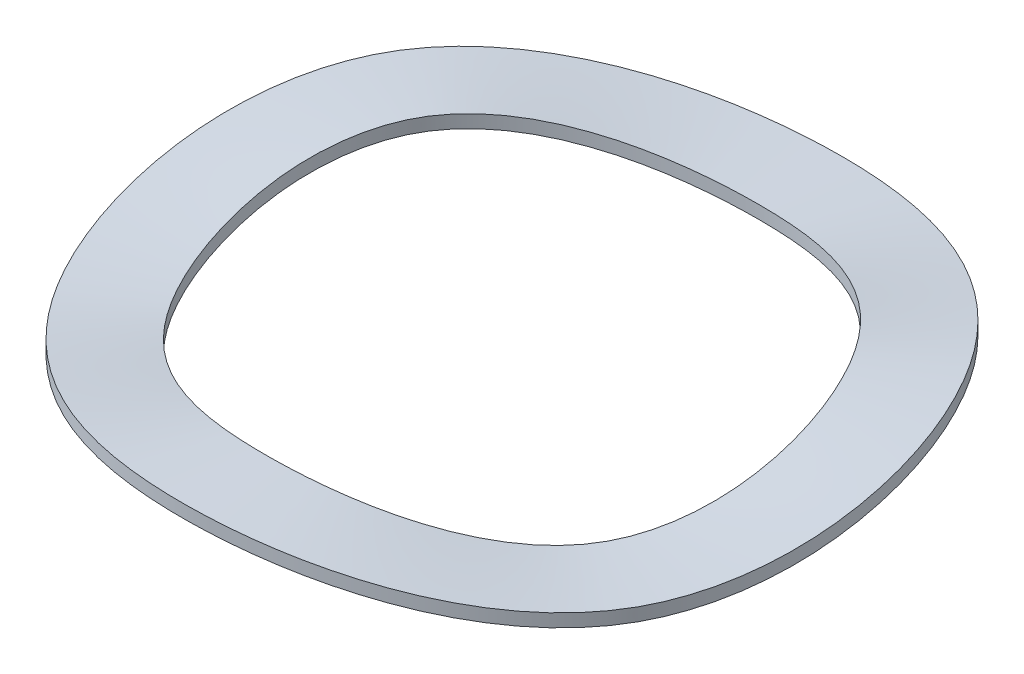
ISO-10303-21;
HEADER;
FILE_DESCRIPTION(('STEP AP214'),'2;1');
FILE_NAME('part.step','',(''),(''),'','','');
FILE_SCHEMA(('AUTOMOTIVE_DESIGN { 1 0 10303 214 1 1 1 1 }'));
ENDSEC;
DATA;
#1=APPLICATION_CONTEXT('core data for automotive mechanical design processes');
#2=APPLICATION_PROTOCOL_DEFINITION('international standard','automotive_design',2000,#1);
#3=PRODUCT_CONTEXT('',#1,'mechanical');
#4=PRODUCT('Part','Part','',(#3));
#5=PRODUCT_RELATED_PRODUCT_CATEGORY('part','',(#4));
#6=PRODUCT_DEFINITION_FORMATION('','',#4);
#7=PRODUCT_DEFINITION_CONTEXT('part definition',#1,'design');
#8=PRODUCT_DEFINITION('design','',#6,#7);
#9=PRODUCT_DEFINITION_SHAPE('','',#8);
#10=(LENGTH_UNIT() NAMED_UNIT(*) SI_UNIT(.MILLI.,.METRE.));
#11=(NAMED_UNIT(*) PLANE_ANGLE_UNIT() SI_UNIT($,.RADIAN.));
#12=(NAMED_UNIT(*) SI_UNIT($,.STERADIAN.) SOLID_ANGLE_UNIT());
#13=UNCERTAINTY_MEASURE_WITH_UNIT(LENGTH_MEASURE(1.E-05),#10,'distance_accuracy_value','');
#14=(GEOMETRIC_REPRESENTATION_CONTEXT(3) GLOBAL_UNCERTAINTY_ASSIGNED_CONTEXT((#13)) GLOBAL_UNIT_ASSIGNED_CONTEXT((#10,
#11,#12)) REPRESENTATION_CONTEXT('',''));
#15=CARTESIAN_POINT('',(0.,0.,0.));
#16=DIRECTION('',(0.,0.,1.));
#17=DIRECTION('',(1.,0.,0.));
#18=AXIS2_PLACEMENT_3D('',#15,#16,#17);
#19=CARTESIAN_POINT('',(0.,0.508000000000008,-12.9032));
#20=CARTESIAN_POINT('',(4.46979959604456,0.508000000000008,-12.9032));
#21=CARTESIAN_POINT('',(13.4093987881337,2.8956,-7.74192000000002));
#22=CARTESIAN_POINT('',(13.4093987881336,-0.685799999999986,7.74192000000007));
#23=CARTESIAN_POINT('',(0.,2.8956,15.48384));
#24=CARTESIAN_POINT('',(-13.4093987881338,-0.685799999999986,7.74191999999997));
#25=CARTESIAN_POINT('',(-13.4093987881337,1.7018,-2.58064000000007));
#26=CARTESIAN_POINT('',(-8.9395991920891,1.7018,-10.3225600000001));
#27=CARTESIAN_POINT('',(-4.46979959604455,0.508000000000008,-12.9032000000001));
#28=CARTESIAN_POINT('',(0.,0.508000000000008,-12.9032));
#29=CARTESIAN_POINT('',(0.,0.508000000000008,-11.8194666666667));
#30=CARTESIAN_POINT('',(4.0943833570067,0.508000000000008,-11.8194666666667));
#31=CARTESIAN_POINT('',(12.2831500710201,2.8956,-7.09168000000002));
#32=CARTESIAN_POINT('',(12.2831500710201,-0.685799999999986,7.09168000000007));
#33=CARTESIAN_POINT('',(0.,2.8956,14.18336));
#34=CARTESIAN_POINT('',(-12.2831500710202,-0.685800000000014,7.09167999999997));
#35=CARTESIAN_POINT('',(-12.2831500710201,1.7018,-2.3638933333334));
#36=CARTESIAN_POINT('',(-8.18876671401337,1.7018,-9.45557333333342));
#37=CARTESIAN_POINT('',(-4.09438335700669,0.508000000000008,-11.8194666666667));
#38=CARTESIAN_POINT('',(0.,0.508000000000008,-11.8194666666667));
#39=CARTESIAN_POINT('',(0.,0.508000000000008,-10.7357333333334));
#40=CARTESIAN_POINT('',(3.71896711796883,0.508000000000008,-10.7357333333334));
#41=CARTESIAN_POINT('',(11.1569013539065,2.8956,-6.44144));
#42=CARTESIAN_POINT('',(11.1569013539065,-0.685799999999986,6.44144000000006));
#43=CARTESIAN_POINT('',(0.,2.8956,12.88288));
#44=CARTESIAN_POINT('',(-11.1569013539066,-0.685800000000014,6.44143999999999));
#45=CARTESIAN_POINT('',(-11.1569013539065,1.7018,-2.14714666666673));
#46=CARTESIAN_POINT('',(-7.43793423593765,1.7018,-8.58858666666675));
#47=CARTESIAN_POINT('',(-3.71896711796883,0.508000000000008,-10.7357333333334));
#48=CARTESIAN_POINT('',(0.,0.508000000000008,-10.7357333333334));
#49=CARTESIAN_POINT('',(0.,0.508000000000008,-9.65200000000003));
#50=CARTESIAN_POINT('',(3.34355087893097,0.508000000000008,-9.65200000000002));
#51=CARTESIAN_POINT('',(10.0306526367929,2.8956,-5.79120000000001));
#52=CARTESIAN_POINT('',(10.0306526367929,-0.685800000000014,5.79120000000005));
#53=CARTESIAN_POINT('',(0.,2.8956,11.5824));
#54=CARTESIAN_POINT('',(-10.030652636793,-0.685800000000014,5.79119999999999));
#55=CARTESIAN_POINT('',(-10.0306526367929,1.7018,-1.93040000000005));
#56=CARTESIAN_POINT('',(-6.68710175786192,1.7018,-7.72160000000005));
#57=CARTESIAN_POINT('',(-3.34355087893097,0.508000000000008,-9.65200000000005));
#58=CARTESIAN_POINT('',(0.,0.508000000000008,-9.65200000000003));
#59=B_SPLINE_SURFACE_WITH_KNOTS('',3,3,((#19,#20,#21,#22,#23,#24,#25,#26,#27,#28),(#29,#30,#31,
#32,#33,#34,#35,#36,#37,#38),(#39,#40,#41,#42,#43,#44,#45,#46,#47,#48),(#49,#50,#51,#52,#53,#54,
#55,#56,#57,#58)),.UNSPECIFIED.,.F.,.T.,.F.,(4,4),(4,1,1,1,1,2,4),(0.,1.),(0.,0.166666666666667,
0.333333333333334,0.5,0.666666666666666,0.833333333333333,1.),.UNSPECIFIED.);
#60=CARTESIAN_POINT('',(0.,0.508000000000008,-9.65200000000003));
#61=CARTESIAN_POINT('',(3.34355087893097,0.508000000000008,-9.65200000000002));
#62=CARTESIAN_POINT('',(10.0306526367929,2.8956,-5.79120000000001));
#63=CARTESIAN_POINT('',(10.0306526367929,-0.685800000000014,5.79120000000005));
#64=CARTESIAN_POINT('',(0.,2.8956,11.5824));
#65=CARTESIAN_POINT('',(-10.030652636793,-0.685800000000014,5.79119999999999));
#66=CARTESIAN_POINT('',(-10.0306526367929,1.7018,-1.93040000000005));
#67=CARTESIAN_POINT('',(-6.68710175786192,1.7018,-7.72160000000005));
#68=CARTESIAN_POINT('',(-3.34355087893097,0.508000000000008,-9.65200000000005));
#69=CARTESIAN_POINT('',(0.,0.508000000000008,-9.65200000000003));
#70=B_SPLINE_CURVE_WITH_KNOTS('',3,(#60,#61,#62,#63,#64,#65,#66,#67,#68,#69),.UNSPECIFIED.,.T.,
.F.,(4,1,1,1,1,2,4),(0.,0.166666666666667,0.333333333333334,0.5,0.666666666666666,
0.833333333333333,1.),.UNSPECIFIED.);
#71=CARTESIAN_POINT('',(0.,0.508000000000008,-9.65200000000003));
#72=VERTEX_POINT('',#71);
#73=EDGE_CURVE('E21',#72,#72,#70,.F.);
#74=CARTESIAN_POINT('',(0.,0.508000000000008,-12.9032));
#75=CARTESIAN_POINT('',(4.46979959604456,0.508000000000008,-12.9032));
#76=CARTESIAN_POINT('',(13.4093987881337,2.8956,-7.74192000000002));
#77=CARTESIAN_POINT('',(13.4093987881336,-0.685799999999986,7.74192000000007));
#78=CARTESIAN_POINT('',(0.,2.8956,15.48384));
#79=CARTESIAN_POINT('',(-13.4093987881338,-0.685799999999986,7.74191999999997));
#80=CARTESIAN_POINT('',(-13.4093987881337,1.7018,-2.58064000000007));
#81=CARTESIAN_POINT('',(-8.9395991920891,1.7018,-10.3225600000001));
#82=CARTESIAN_POINT('',(-4.46979959604455,0.508000000000008,-12.9032000000001));
#83=CARTESIAN_POINT('',(0.,0.508000000000008,-12.9032));
#84=B_SPLINE_CURVE_WITH_KNOTS('',3,(#74,#75,#76,#77,#78,#79,#80,#81,#82,#83),.UNSPECIFIED.,.T.,
.F.,(4,1,1,1,1,2,4),(0.,0.166666666666667,0.333333333333334,0.5,0.666666666666666,
0.833333333333333,1.),.UNSPECIFIED.);
#85=CARTESIAN_POINT('',(0.,0.508000000000008,-12.9032));
#86=VERTEX_POINT('',#85);
#87=EDGE_CURVE('E32',#86,#86,#84,.T.);
#88=ORIENTED_EDGE('',*,*,#73,.F.);
#89=EDGE_LOOP('',(#88));
#90=FACE_BOUND('',#89,.T.);
#91=ORIENTED_EDGE('',*,*,#87,.F.);
#92=EDGE_LOOP('',(#91));
#93=FACE_BOUND('',#92,.T.);
#94=ADVANCED_FACE('F15',(#90,#93),#59,.T.);
#95=CARTESIAN_POINT('',(0.,0.508000000000008,-9.65200000000003));
#96=CARTESIAN_POINT('',(3.34355087893097,0.508000000000008,-9.65200000000002));
#97=CARTESIAN_POINT('',(10.0306526367929,2.8956,-5.79120000000001));
#98=CARTESIAN_POINT('',(10.0306526367929,-0.685800000000014,5.79120000000005));
#99=CARTESIAN_POINT('',(0.,2.8956,11.5824));
#100=CARTESIAN_POINT('',(-10.030652636793,-0.685800000000014,5.79119999999999));
#101=CARTESIAN_POINT('',(-10.0306526367929,1.7018,-1.93040000000005));
#102=CARTESIAN_POINT('',(-6.68710175786192,1.7018,-7.72160000000005));
#103=CARTESIAN_POINT('',(-3.34355087893097,0.508000000000008,-9.65200000000005));
#104=CARTESIAN_POINT('',(0.,0.508000000000008,-9.65200000000003));
#105=CARTESIAN_POINT('',(0.,0.338666666666654,-9.65200000000003));
#106=CARTESIAN_POINT('',(3.34355087893097,0.338666666666654,-9.65200000000002));
#107=CARTESIAN_POINT('',(10.0306526367929,2.72626666666667,-5.79120000000001));
#108=CARTESIAN_POINT('',(10.0306526367929,-0.855133333333341,5.79120000000005));
#109=CARTESIAN_POINT('',(0.,2.72626666666667,11.5824));
#110=CARTESIAN_POINT('',(-10.030652636793,-0.855133333333341,5.79119999999999));
#111=CARTESIAN_POINT('',(-10.0306526367929,1.53246666666668,-1.93040000000005));
#112=CARTESIAN_POINT('',(-6.68710175786192,1.53246666666668,-7.72160000000005));
#113=CARTESIAN_POINT('',(-3.34355087893097,0.338666666666654,-9.65200000000005));
#114=CARTESIAN_POINT('',(0.,0.338666666666654,-9.65200000000003));
#115=CARTESIAN_POINT('',(0.,0.169333333333327,-9.65200000000003));
#116=CARTESIAN_POINT('',(3.34355087893097,0.169333333333327,-9.65200000000002));
#117=CARTESIAN_POINT('',(10.0306526367929,2.55693333333334,-5.79120000000001));
#118=CARTESIAN_POINT('',(10.0306526367929,-1.02446666666667,5.79120000000005));
#119=CARTESIAN_POINT('',(0.,2.55693333333334,11.5824));
#120=CARTESIAN_POINT('',(-10.030652636793,-1.02446666666667,5.79119999999999));
#121=CARTESIAN_POINT('',(-10.0306526367929,1.36313333333332,-1.93040000000005));
#122=CARTESIAN_POINT('',(-6.68710175786192,1.36313333333332,-7.72160000000006));
#123=CARTESIAN_POINT('',(-3.34355087893097,0.169333333333327,-9.65200000000004));
#124=CARTESIAN_POINT('',(0.,0.169333333333327,-9.65200000000003));
#125=CARTESIAN_POINT('',(0.,0.,-9.65200000000003));
#126=CARTESIAN_POINT('',(3.34355087893097,0.,-9.65200000000002));
#127=CARTESIAN_POINT('',(10.0306526367929,2.38759999999999,-5.79120000000001));
#128=CARTESIAN_POINT('',(10.0306526367929,-1.19379999999999,5.79120000000005));
#129=CARTESIAN_POINT('',(0.,2.38759999999999,11.5824));
#130=CARTESIAN_POINT('',(-10.030652636793,-1.19379999999999,5.79119999999999));
#131=CARTESIAN_POINT('',(-10.0306526367929,1.19379999999999,-1.93040000000005));
#132=CARTESIAN_POINT('',(-6.68710175786192,1.19379999999999,-7.72160000000006));
#133=CARTESIAN_POINT('',(-3.34355087893097,0.,-9.65200000000005));
#134=CARTESIAN_POINT('',(0.,0.,-9.65200000000003));
#135=B_SPLINE_SURFACE_WITH_KNOTS('',3,3,((#95,#96,#97,#98,#99,#100,#101,#102,#103,#104),(#105,
#106,#107,#108,#109,#110,#111,#112,#113,#114),(#115,#116,#117,#118,#119,#120,#121,#122,#123,
#124),(#125,#126,#127,#128,#129,#130,#131,#132,#133,#134)),.UNSPECIFIED.,.F.,.T.,.F.,(4,4),(4,1,
1,1,1,2,4),(0.,1.),(0.,0.166666666666667,0.333333333333334,0.5,0.666666666666666,
0.833333333333333,1.),.UNSPECIFIED.);
#136=CARTESIAN_POINT('',(0.,0.,-9.65200000000003));
#137=CARTESIAN_POINT('',(3.34355087893097,0.,-9.65200000000002));
#138=CARTESIAN_POINT('',(10.0306526367929,2.38759999999999,-5.79120000000001));
#139=CARTESIAN_POINT('',(10.0306526367929,-1.19379999999999,5.79120000000005));
#140=CARTESIAN_POINT('',(0.,2.38759999999999,11.5824));
#141=CARTESIAN_POINT('',(-10.030652636793,-1.19379999999999,5.79119999999999));
#142=CARTESIAN_POINT('',(-10.0306526367929,1.19379999999999,-1.93040000000005));
#143=CARTESIAN_POINT('',(-6.68710175786192,1.19379999999999,-7.72160000000006));
#144=CARTESIAN_POINT('',(-3.34355087893097,0.,-9.65200000000005));
#145=CARTESIAN_POINT('',(0.,0.,-9.65200000000003));
#146=B_SPLINE_CURVE_WITH_KNOTS('',3,(#136,#137,#138,#139,#140,#141,#142,#143,#144,#145),
.UNSPECIFIED.,.T.,.F.,(4,1,1,1,1,2,4),(0.,0.166666666666667,0.333333333333334,0.5,
0.666666666666666,0.833333333333333,1.),.UNSPECIFIED.);
#147=CARTESIAN_POINT('',(0.,0.,-9.65200000000003));
#148=VERTEX_POINT('',#147);
#149=EDGE_CURVE('E27',#148,#148,#146,.F.);
#150=ORIENTED_EDGE('',*,*,#149,.F.);
#151=EDGE_LOOP('',(#150));
#152=FACE_BOUND('',#151,.T.);
#153=ORIENTED_EDGE('',*,*,#73,.T.);
#154=EDGE_LOOP('',(#153));
#155=FACE_BOUND('',#154,.T.);
#156=ADVANCED_FACE('F55',(#152,#155),#135,.T.);
#157=CARTESIAN_POINT('',(0.,0.,-12.9032));
#158=CARTESIAN_POINT('',(4.46979959604456,0.,-12.9032));
#159=CARTESIAN_POINT('',(13.4093987881337,2.38759999999999,-7.74192000000002));
#160=CARTESIAN_POINT('',(13.4093987881336,-1.19379999999999,7.74192000000007));
#161=CARTESIAN_POINT('',(0.,2.38759999999999,15.48384));
#162=CARTESIAN_POINT('',(-13.4093987881338,-1.19379999999999,7.74191999999998));
#163=CARTESIAN_POINT('',(-13.4093987881337,1.19379999999999,-2.58064000000007));
#164=CARTESIAN_POINT('',(-8.9395991920891,1.19379999999999,-10.3225600000001));
#165=CARTESIAN_POINT('',(-4.46979959604455,0.,-12.9032000000001));
#166=CARTESIAN_POINT('',(0.,0.,-12.9032));
#167=CARTESIAN_POINT('',(0.,0.169333333333327,-12.9032));
#168=CARTESIAN_POINT('',(4.46979959604456,0.169333333333327,-12.9032));
#169=CARTESIAN_POINT('',(13.4093987881337,2.55693333333334,-7.74192000000002));
#170=CARTESIAN_POINT('',(13.4093987881336,-1.02446666666667,7.74192000000007));
#171=CARTESIAN_POINT('',(0.,2.55693333333334,15.48384));
#172=CARTESIAN_POINT('',(-13.4093987881338,-1.02446666666667,7.74191999999998));
#173=CARTESIAN_POINT('',(-13.4093987881337,1.36313333333332,-2.58064000000007));
#174=CARTESIAN_POINT('',(-8.9395991920891,1.36313333333332,-10.3225600000001));
#175=CARTESIAN_POINT('',(-4.46979959604455,0.169333333333327,-12.9032000000001));
#176=CARTESIAN_POINT('',(0.,0.169333333333327,-12.9032));
#177=CARTESIAN_POINT('',(0.,0.338666666666654,-12.9032));
#178=CARTESIAN_POINT('',(4.46979959604456,0.338666666666654,-12.9032));
#179=CARTESIAN_POINT('',(13.4093987881337,2.72626666666667,-7.74192000000002));
#180=CARTESIAN_POINT('',(13.4093987881336,-0.855133333333341,7.74192000000007));
#181=CARTESIAN_POINT('',(0.,2.72626666666667,15.48384));
#182=CARTESIAN_POINT('',(-13.4093987881338,-0.855133333333341,7.74191999999997));
#183=CARTESIAN_POINT('',(-13.4093987881337,1.53246666666668,-2.58064000000007));
#184=CARTESIAN_POINT('',(-8.9395991920891,1.53246666666668,-10.3225600000001));
#185=CARTESIAN_POINT('',(-4.46979959604455,0.338666666666654,-12.9032000000001));
#186=CARTESIAN_POINT('',(0.,0.338666666666654,-12.9032));
#187=CARTESIAN_POINT('',(0.,0.508000000000008,-12.9032));
#188=CARTESIAN_POINT('',(4.46979959604456,0.508000000000008,-12.9032));
#189=CARTESIAN_POINT('',(13.4093987881337,2.8956,-7.74192000000002));
#190=CARTESIAN_POINT('',(13.4093987881336,-0.685799999999986,7.74192000000007));
#191=CARTESIAN_POINT('',(0.,2.8956,15.48384));
#192=CARTESIAN_POINT('',(-13.4093987881338,-0.685799999999986,7.74191999999997));
#193=CARTESIAN_POINT('',(-13.4093987881337,1.7018,-2.58064000000007));
#194=CARTESIAN_POINT('',(-8.9395991920891,1.7018,-10.3225600000001));
#195=CARTESIAN_POINT('',(-4.46979959604455,0.508000000000008,-12.9032000000001));
#196=CARTESIAN_POINT('',(0.,0.508000000000008,-12.9032));
#197=B_SPLINE_SURFACE_WITH_KNOTS('',3,3,((#157,#158,#159,#160,#161,#162,#163,#164,#165,#166),
(#167,#168,#169,#170,#171,#172,#173,#174,#175,#176),(#177,#178,#179,#180,#181,#182,#183,#184,
#185,#186),(#187,#188,#189,#190,#191,#192,#193,#194,#195,#196)),.UNSPECIFIED.,.F.,.T.,.F.,(4,4),
(4,1,1,1,1,2,4),(0.,1.),(0.,0.166666666666667,0.333333333333334,0.5,0.666666666666666,
0.833333333333333,1.),.UNSPECIFIED.);
#198=CARTESIAN_POINT('',(0.,0.,-12.9032));
#199=CARTESIAN_POINT('',(4.46979959604456,0.,-12.9032));
#200=CARTESIAN_POINT('',(13.4093987881337,2.38759999999999,-7.74192000000002));
#201=CARTESIAN_POINT('',(13.4093987881336,-1.19379999999999,7.74192000000007));
#202=CARTESIAN_POINT('',(0.,2.38759999999999,15.48384));
#203=CARTESIAN_POINT('',(-13.4093987881338,-1.19379999999999,7.74191999999998));
#204=CARTESIAN_POINT('',(-13.4093987881337,1.19379999999999,-2.58064000000007));
#205=CARTESIAN_POINT('',(-8.9395991920891,1.19379999999999,-10.3225600000001));
#206=CARTESIAN_POINT('',(-4.46979959604455,0.,-12.9032000000001));
#207=CARTESIAN_POINT('',(0.,0.,-12.9032));
#208=B_SPLINE_CURVE_WITH_KNOTS('',3,(#198,#199,#200,#201,#202,#203,#204,#205,#206,#207),
.UNSPECIFIED.,.T.,.F.,(4,1,1,1,1,2,4),(0.,0.166666666666667,0.333333333333334,0.5,
0.666666666666666,0.833333333333333,1.),.UNSPECIFIED.);
#209=CARTESIAN_POINT('',(0.,0.,-12.9032));
#210=VERTEX_POINT('',#209);
#211=EDGE_CURVE('E10',#210,#210,#208,.T.);
#212=ORIENTED_EDGE('',*,*,#87,.T.);
#213=EDGE_LOOP('',(#212));
#214=FACE_BOUND('',#213,.T.);
#215=ORIENTED_EDGE('',*,*,#211,.F.);
#216=EDGE_LOOP('',(#215));
#217=FACE_BOUND('',#216,.T.);
#218=ADVANCED_FACE('F64',(#214,#217),#197,.T.);
#219=CARTESIAN_POINT('',(0.,0.,-9.65200000000003));
#220=CARTESIAN_POINT('',(3.34355087893097,0.,-9.65200000000002));
#221=CARTESIAN_POINT('',(10.0306526367929,2.38759999999999,-5.79120000000001));
#222=CARTESIAN_POINT('',(10.0306526367929,-1.19379999999999,5.79120000000005));
#223=CARTESIAN_POINT('',(0.,2.38759999999999,11.5824));
#224=CARTESIAN_POINT('',(-10.030652636793,-1.19379999999999,5.79119999999999));
#225=CARTESIAN_POINT('',(-10.0306526367929,1.19379999999999,-1.93040000000005));
#226=CARTESIAN_POINT('',(-6.68710175786192,1.19379999999999,-7.72160000000006));
#227=CARTESIAN_POINT('',(-3.34355087893097,0.,-9.65200000000005));
#228=CARTESIAN_POINT('',(0.,0.,-9.65200000000003));
#229=CARTESIAN_POINT('',(0.,0.,-10.7357333333334));
#230=CARTESIAN_POINT('',(3.71896711796883,0.,-10.7357333333334));
#231=CARTESIAN_POINT('',(11.1569013539065,2.38759999999999,-6.44144000000001));
#232=CARTESIAN_POINT('',(11.1569013539065,-1.19379999999999,6.44144000000006));
#233=CARTESIAN_POINT('',(0.,2.38759999999999,12.88288));
#234=CARTESIAN_POINT('',(-11.1569013539066,-1.19379999999999,6.44143999999999));
#235=CARTESIAN_POINT('',(-11.1569013539065,1.19379999999999,-2.14714666666672));
#236=CARTESIAN_POINT('',(-7.43793423593764,1.19379999999999,-8.58858666666675));
#237=CARTESIAN_POINT('',(-3.71896711796883,0.,-10.7357333333334));
#238=CARTESIAN_POINT('',(0.,0.,-10.7357333333334));
#239=CARTESIAN_POINT('',(0.,0.,-11.8194666666667));
#240=CARTESIAN_POINT('',(4.0943833570067,0.,-11.8194666666667));
#241=CARTESIAN_POINT('',(12.2831500710201,2.38759999999999,-7.09168000000002));
#242=CARTESIAN_POINT('',(12.2831500710201,-1.19379999999999,7.09168000000007));
#243=CARTESIAN_POINT('',(0.,2.38759999999999,14.18336));
#244=CARTESIAN_POINT('',(-12.2831500710202,-1.19379999999999,7.09167999999998));
#245=CARTESIAN_POINT('',(-12.2831500710201,1.19379999999999,-2.3638933333334));
#246=CARTESIAN_POINT('',(-8.18876671401337,1.19379999999999,-9.45557333333342));
#247=CARTESIAN_POINT('',(-4.09438335700669,0.,-11.8194666666667));
#248=CARTESIAN_POINT('',(0.,0.,-11.8194666666667));
#249=CARTESIAN_POINT('',(0.,0.,-12.9032));
#250=CARTESIAN_POINT('',(4.46979959604456,0.,-12.9032));
#251=CARTESIAN_POINT('',(13.4093987881337,2.38759999999999,-7.74192000000002));
#252=CARTESIAN_POINT('',(13.4093987881336,-1.19379999999999,7.74192000000007));
#253=CARTESIAN_POINT('',(0.,2.38759999999999,15.48384));
#254=CARTESIAN_POINT('',(-13.4093987881338,-1.19379999999999,7.74191999999998));
#255=CARTESIAN_POINT('',(-13.4093987881337,1.19379999999999,-2.58064000000007));
#256=CARTESIAN_POINT('',(-8.9395991920891,1.19379999999999,-10.3225600000001));
#257=CARTESIAN_POINT('',(-4.46979959604455,0.,-12.9032000000001));
#258=CARTESIAN_POINT('',(0.,0.,-12.9032));
#259=B_SPLINE_SURFACE_WITH_KNOTS('',3,3,((#219,#220,#221,#222,#223,#224,#225,#226,#227,#228),
(#229,#230,#231,#232,#233,#234,#235,#236,#237,#238),(#239,#240,#241,#242,#243,#244,#245,#246,
#247,#248),(#249,#250,#251,#252,#253,#254,#255,#256,#257,#258)),.UNSPECIFIED.,.F.,.T.,.F.,(4,4),
(4,1,1,1,1,2,4),(0.,1.),(0.,0.166666666666667,0.333333333333334,0.5,0.666666666666666,
0.833333333333333,1.),.UNSPECIFIED.);
#260=ORIENTED_EDGE('',*,*,#211,.T.);
#261=EDGE_LOOP('',(#260));
#262=FACE_BOUND('',#261,.T.);
#263=ORIENTED_EDGE('',*,*,#149,.T.);
#264=EDGE_LOOP('',(#263));
#265=FACE_BOUND('',#264,.T.);
#266=ADVANCED_FACE('F17',(#262,#265),#259,.T.);
#267=CLOSED_SHELL('',(#94,#156,#218,#266));
#268=MANIFOLD_SOLID_BREP('B1',#267);
#269=ADVANCED_BREP_SHAPE_REPRESENTATION('',(#18,#268),#14);
#270=SHAPE_DEFINITION_REPRESENTATION(#9,#269);
ENDSEC;
END-ISO-10303-21;
